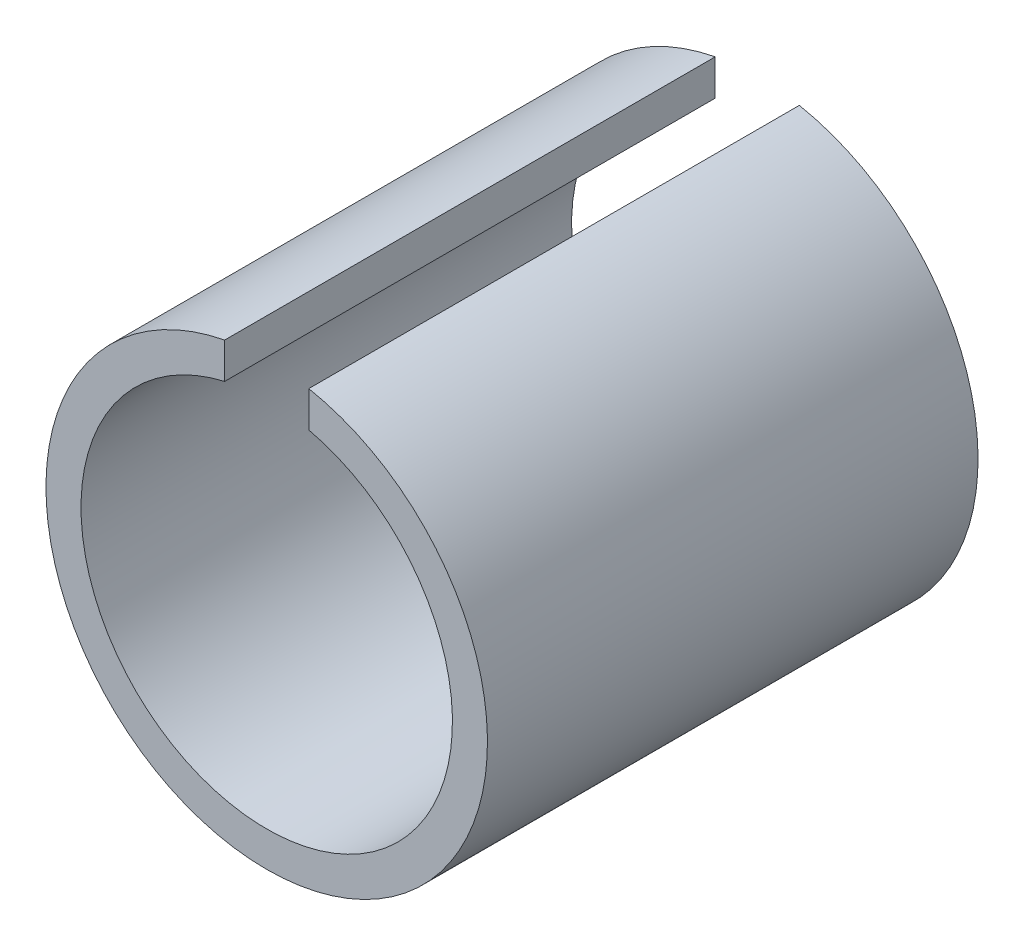
ISO-10303-21;
HEADER;
FILE_DESCRIPTION(('STEP AP214'),'2;1');
FILE_NAME('part.step','',(''),(''),'','','');
FILE_SCHEMA(('AUTOMOTIVE_DESIGN { 1 0 10303 214 1 1 1 1 }'));
ENDSEC;
DATA;
#1=APPLICATION_CONTEXT('core data for automotive mechanical design processes');
#2=APPLICATION_PROTOCOL_DEFINITION('international standard','automotive_design',2000,#1);
#3=PRODUCT_CONTEXT('',#1,'mechanical');
#4=PRODUCT('Part','Part','',(#3));
#5=PRODUCT_RELATED_PRODUCT_CATEGORY('part','',(#4));
#6=PRODUCT_DEFINITION_FORMATION('','',#4);
#7=PRODUCT_DEFINITION_CONTEXT('part definition',#1,'design');
#8=PRODUCT_DEFINITION('design','',#6,#7);
#9=PRODUCT_DEFINITION_SHAPE('','',#8);
#10=(LENGTH_UNIT() NAMED_UNIT(*) SI_UNIT(.MILLI.,.METRE.));
#11=(NAMED_UNIT(*) PLANE_ANGLE_UNIT() SI_UNIT($,.RADIAN.));
#12=(NAMED_UNIT(*) SI_UNIT($,.STERADIAN.) SOLID_ANGLE_UNIT());
#13=UNCERTAINTY_MEASURE_WITH_UNIT(LENGTH_MEASURE(1.E-05),#10,'distance_accuracy_value','');
#14=(GEOMETRIC_REPRESENTATION_CONTEXT(3) GLOBAL_UNCERTAINTY_ASSIGNED_CONTEXT((#13)) GLOBAL_UNIT_ASSIGNED_CONTEXT((#10,
#11,#12)) REPRESENTATION_CONTEXT('',''));
#15=CARTESIAN_POINT('',(0.,0.,0.));
#16=DIRECTION('',(0.,0.,1.));
#17=DIRECTION('',(1.,0.,0.));
#18=AXIS2_PLACEMENT_3D('',#15,#16,#17);
#19=CARTESIAN_POINT('',(0.,0.,7.));
#20=DIRECTION('',(0.,0.,-1.));
#21=DIRECTION('',(-1.,0.,0.));
#22=AXIS2_PLACEMENT_3D('',#19,#20,#21);
#23=CYLINDRICAL_SURFACE('',#22,3.15);
#24=CARTESIAN_POINT('',(0.,0.,0.));
#25=DIRECTION('',(0.,0.,1.));
#26=DIRECTION('',(1.,0.,0.));
#27=AXIS2_PLACEMENT_3D('',#24,#25,#26);
#28=CIRCLE('',#27,3.15);
#29=CARTESIAN_POINT('',(-0.6,3.09232921921325,0.));
#30=VERTEX_POINT('',#29);
#31=CARTESIAN_POINT('',(0.6,3.09232921921325,0.));
#32=VERTEX_POINT('',#31);
#33=EDGE_CURVE('E95',#30,#32,#28,.T.);
#34=ORIENTED_EDGE('',*,*,#33,.T.);
#35=DIRECTION('',(0.,0.,-1.));
#36=VECTOR('',#35,1.);
#37=CARTESIAN_POINT('',(0.6,3.09232921921325,7.));
#38=LINE('',#37,#36);
#39=CARTESIAN_POINT('',(0.6,3.09232921921325,7.));
#40=VERTEX_POINT('',#39);
#41=EDGE_CURVE('E11',#40,#32,#38,.T.);
#42=ORIENTED_EDGE('',*,*,#41,.F.);
#43=CARTESIAN_POINT('',(0.,0.,7.));
#44=DIRECTION('',(0.,0.,1.));
#45=DIRECTION('',(1.,0.,0.));
#46=AXIS2_PLACEMENT_3D('',#43,#44,#45);
#47=CIRCLE('',#46,3.15);
#48=CARTESIAN_POINT('',(-0.6,3.09232921921325,7.));
#49=VERTEX_POINT('',#48);
#50=EDGE_CURVE('E83',#49,#40,#47,.T.);
#51=ORIENTED_EDGE('',*,*,#50,.F.);
#52=DIRECTION('',(0.,0.,-1.));
#53=VECTOR('',#52,1.);
#54=CARTESIAN_POINT('',(-0.6,3.09232921921325,7.));
#55=LINE('',#54,#53);
#56=EDGE_CURVE('E91',#49,#30,#55,.T.);
#57=ORIENTED_EDGE('',*,*,#56,.T.);
#58=EDGE_LOOP('',(#34,#42,#51,#57));
#59=FACE_BOUND('',#58,.T.);
#60=ADVANCED_FACE('F32',(#59),#23,.T.);
#61=CARTESIAN_POINT('',(0.6,3.09232921921325,7.));
#62=DIRECTION('',(1.,0.,0.));
#63=DIRECTION('',(0.,0.,-1.));
#64=AXIS2_PLACEMENT_3D('',#61,#62,#63);
#65=PLANE('',#64);
#66=DIRECTION('',(0.,-1.,0.));
#67=VECTOR('',#66,1.);
#68=CARTESIAN_POINT('',(0.6,3.09232921921325,0.));
#69=LINE('',#68,#67);
#70=CARTESIAN_POINT('',(0.599999999999999,2.58118189982806,0.));
#71=VERTEX_POINT('',#70);
#72=EDGE_CURVE('E87',#32,#71,#69,.T.);
#73=ORIENTED_EDGE('',*,*,#72,.T.);
#74=DIRECTION('',(0.,0.,-1.));
#75=VECTOR('',#74,1.);
#76=CARTESIAN_POINT('',(0.599999999999999,2.58118189982806,7.));
#77=LINE('',#76,#75);
#78=CARTESIAN_POINT('',(0.599999999999999,2.58118189982806,7.));
#79=VERTEX_POINT('',#78);
#80=EDGE_CURVE('E40',#79,#71,#77,.T.);
#81=ORIENTED_EDGE('',*,*,#80,.F.);
#82=DIRECTION('',(0.,-1.,0.));
#83=VECTOR('',#82,1.);
#84=CARTESIAN_POINT('',(0.6,3.09232921921325,7.));
#85=LINE('',#84,#83);
#86=EDGE_CURVE('E78',#40,#79,#85,.T.);
#87=ORIENTED_EDGE('',*,*,#86,.F.);
#88=ORIENTED_EDGE('',*,*,#41,.T.);
#89=EDGE_LOOP('',(#73,#81,#87,#88));
#90=FACE_BOUND('',#89,.T.);
#91=ADVANCED_FACE('F86',(#90),#65,.F.);
#92=CARTESIAN_POINT('',(0.,0.,7.));
#93=DIRECTION('',(0.,0.,-1.));
#94=DIRECTION('',(-1.,0.,0.));
#95=AXIS2_PLACEMENT_3D('',#92,#93,#94);
#96=CYLINDRICAL_SURFACE('',#95,2.65);
#97=CARTESIAN_POINT('',(0.,0.,0.));
#98=DIRECTION('',(0.,0.,-1.));
#99=DIRECTION('',(1.,0.,0.));
#100=AXIS2_PLACEMENT_3D('',#97,#98,#99);
#101=CIRCLE('',#100,2.65);
#102=CARTESIAN_POINT('',(-0.6,2.58118189982806,0.));
#103=VERTEX_POINT('',#102);
#104=EDGE_CURVE('E65',#71,#103,#101,.T.);
#105=ORIENTED_EDGE('',*,*,#104,.T.);
#106=DIRECTION('',(0.,0.,-1.));
#107=VECTOR('',#106,1.);
#108=CARTESIAN_POINT('',(-0.6,2.58118189982806,7.));
#109=LINE('',#108,#107);
#110=CARTESIAN_POINT('',(-0.6,2.58118189982806,7.));
#111=VERTEX_POINT('',#110);
#112=EDGE_CURVE('E88',#111,#103,#109,.T.);
#113=ORIENTED_EDGE('',*,*,#112,.F.);
#114=CARTESIAN_POINT('',(0.,0.,7.));
#115=DIRECTION('',(0.,0.,-1.));
#116=DIRECTION('',(1.,0.,0.));
#117=AXIS2_PLACEMENT_3D('',#114,#115,#116);
#118=CIRCLE('',#117,2.65);
#119=EDGE_CURVE('E81',#79,#111,#118,.T.);
#120=ORIENTED_EDGE('',*,*,#119,.F.);
#121=ORIENTED_EDGE('',*,*,#80,.T.);
#122=EDGE_LOOP('',(#105,#113,#120,#121));
#123=FACE_BOUND('',#122,.T.);
#124=ADVANCED_FACE('F89',(#123),#96,.F.);
#125=CARTESIAN_POINT('',(-0.6,3.09232921921325,7.));
#126=DIRECTION('',(-1.,0.,0.));
#127=DIRECTION('',(0.,-1.,0.));
#128=AXIS2_PLACEMENT_3D('',#125,#126,#127);
#129=PLANE('',#128);
#130=DIRECTION('',(0.,1.,0.));
#131=VECTOR('',#130,1.);
#132=CARTESIAN_POINT('',(-0.6,3.09232921921325,0.));
#133=LINE('',#132,#131);
#134=EDGE_CURVE('E71',#103,#30,#133,.T.);
#135=ORIENTED_EDGE('',*,*,#134,.T.);
#136=ORIENTED_EDGE('',*,*,#56,.F.);
#137=DIRECTION('',(0.,1.,0.));
#138=VECTOR('',#137,1.);
#139=CARTESIAN_POINT('',(-0.6,3.09232921921325,7.));
#140=LINE('',#139,#138);
#141=EDGE_CURVE('E48',#111,#49,#140,.T.);
#142=ORIENTED_EDGE('',*,*,#141,.F.);
#143=ORIENTED_EDGE('',*,*,#112,.T.);
#144=EDGE_LOOP('',(#135,#136,#142,#143));
#145=FACE_BOUND('',#144,.T.);
#146=ADVANCED_FACE('F102',(#145),#129,.F.);
#147=CARTESIAN_POINT('',(0.,0.,7.));
#148=DIRECTION('',(0.,0.,1.));
#149=DIRECTION('',(1.,0.,0.));
#150=AXIS2_PLACEMENT_3D('',#147,#148,#149);
#151=PLANE('',#150);
#152=ORIENTED_EDGE('',*,*,#50,.T.);
#153=ORIENTED_EDGE('',*,*,#86,.T.);
#154=ORIENTED_EDGE('',*,*,#119,.T.);
#155=ORIENTED_EDGE('',*,*,#141,.T.);
#156=EDGE_LOOP('',(#152,#153,#154,#155));
#157=FACE_BOUND('',#156,.T.);
#158=ADVANCED_FACE('F79',(#157),#151,.T.);
#159=CARTESIAN_POINT('',(0.,0.,0.));
#160=DIRECTION('',(0.,0.,1.));
#161=DIRECTION('',(1.,0.,0.));
#162=AXIS2_PLACEMENT_3D('',#159,#160,#161);
#163=PLANE('',#162);
#164=ORIENTED_EDGE('',*,*,#33,.F.);
#165=ORIENTED_EDGE('',*,*,#134,.F.);
#166=ORIENTED_EDGE('',*,*,#104,.F.);
#167=ORIENTED_EDGE('',*,*,#72,.F.);
#168=EDGE_LOOP('',(#164,#165,#166,#167));
#169=FACE_BOUND('',#168,.T.);
#170=ADVANCED_FACE('F105',(#169),#163,.F.);
#171=CLOSED_SHELL('',(#60,#91,#124,#146,#158,#170));
#172=MANIFOLD_SOLID_BREP('B2',#171);
#173=ADVANCED_BREP_SHAPE_REPRESENTATION('',(#18,#172),#14);
#174=SHAPE_DEFINITION_REPRESENTATION(#9,#173);
ENDSEC;
END-ISO-10303-21;
